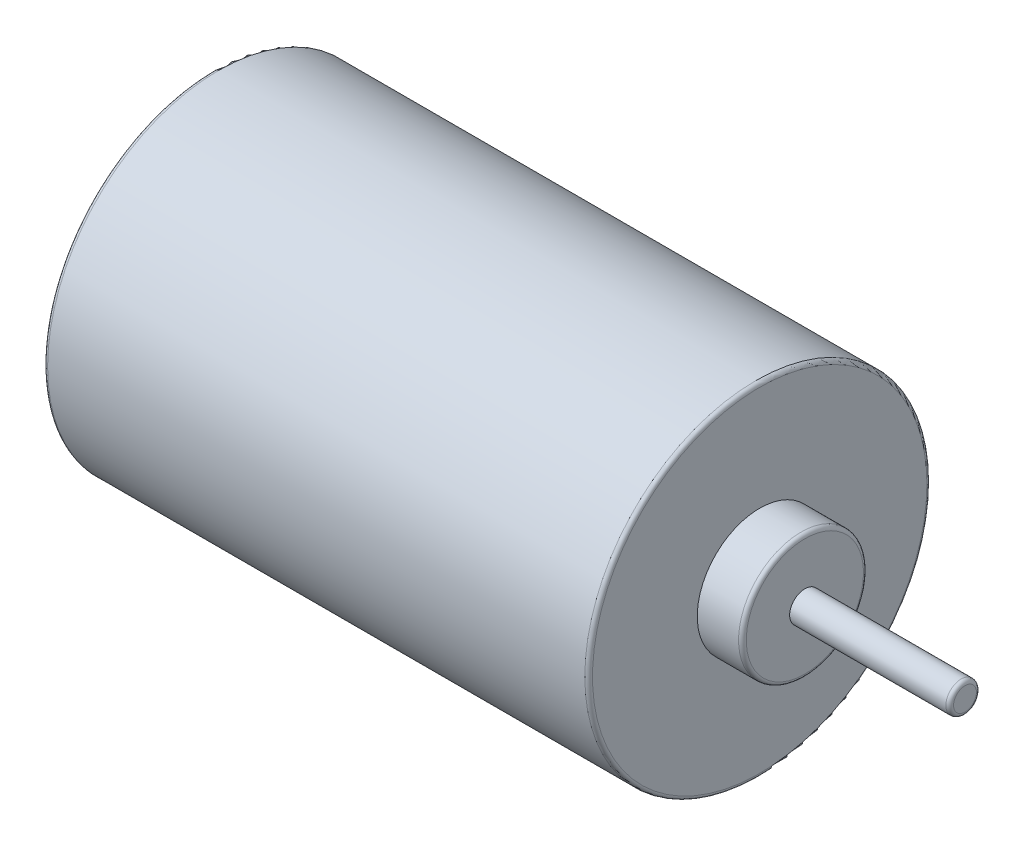
ISO-10303-21;
HEADER;
FILE_DESCRIPTION(('STEP AP214'),'2;1');
FILE_NAME('part.step','',(''),(''),'','','');
FILE_SCHEMA(('AUTOMOTIVE_DESIGN { 1 0 10303 214 1 1 1 1 }'));
ENDSEC;
DATA;
#1=APPLICATION_CONTEXT('core data for automotive mechanical design processes');
#2=APPLICATION_PROTOCOL_DEFINITION('international standard','automotive_design',2000,#1);
#3=PRODUCT_CONTEXT('',#1,'mechanical');
#4=PRODUCT('Part','Part','',(#3));
#5=PRODUCT_RELATED_PRODUCT_CATEGORY('part','',(#4));
#6=PRODUCT_DEFINITION_FORMATION('','',#4);
#7=PRODUCT_DEFINITION_CONTEXT('part definition',#1,'design');
#8=PRODUCT_DEFINITION('design','',#6,#7);
#9=PRODUCT_DEFINITION_SHAPE('','',#8);
#10=(LENGTH_UNIT() NAMED_UNIT(*) SI_UNIT(.MILLI.,.METRE.));
#11=(NAMED_UNIT(*) PLANE_ANGLE_UNIT() SI_UNIT($,.RADIAN.));
#12=(NAMED_UNIT(*) SI_UNIT($,.STERADIAN.) SOLID_ANGLE_UNIT());
#13=UNCERTAINTY_MEASURE_WITH_UNIT(LENGTH_MEASURE(1.E-05),#10,'distance_accuracy_value','');
#14=(GEOMETRIC_REPRESENTATION_CONTEXT(3) GLOBAL_UNCERTAINTY_ASSIGNED_CONTEXT((#13)) GLOBAL_UNIT_ASSIGNED_CONTEXT((#10,
#11,#12)) REPRESENTATION_CONTEXT('',''));
#15=CARTESIAN_POINT('',(0.,0.,0.));
#16=DIRECTION('',(0.,0.,1.));
#17=DIRECTION('',(1.,0.,0.));
#18=AXIS2_PLACEMENT_3D('',#15,#16,#17);
#19=CARTESIAN_POINT('',(56.7,0.,0.));
#20=DIRECTION('',(-1.,0.,0.));
#21=DIRECTION('',(0.,0.,1.));
#22=AXIS2_PLACEMENT_3D('',#19,#20,#21);
#23=CYLINDRICAL_SURFACE('',#22,17.8);
#24=CARTESIAN_POINT('',(56.3,0.,0.));
#25=DIRECTION('',(1.,0.,0.));
#26=DIRECTION('',(0.,0.,-1.));
#27=AXIS2_PLACEMENT_3D('',#24,#25,#26);
#28=CIRCLE('',#27,17.8);
#29=CARTESIAN_POINT('',(56.3,0.,-17.8));
#30=VERTEX_POINT('',#29);
#31=EDGE_CURVE('E59',#30,#30,#28,.F.);
#32=ORIENTED_EDGE('',*,*,#31,.T.);
#33=EDGE_LOOP('',(#32));
#34=FACE_BOUND('',#33,.T.);
#35=CARTESIAN_POINT('',(0.399999999999998,0.,0.));
#36=DIRECTION('',(1.,0.,0.));
#37=DIRECTION('',(0.,0.,-1.));
#38=AXIS2_PLACEMENT_3D('',#35,#36,#37);
#39=CIRCLE('',#38,17.8);
#40=CARTESIAN_POINT('',(0.399999999999998,0.,-17.8));
#41=VERTEX_POINT('',#40);
#42=EDGE_CURVE('E62',#41,#41,#39,.T.);
#43=ORIENTED_EDGE('',*,*,#42,.T.);
#44=EDGE_LOOP('',(#43));
#45=FACE_BOUND('',#44,.T.);
#46=ADVANCED_FACE('F36',(#34,#45),#23,.T.);
#47=CARTESIAN_POINT('',(56.7,0.,0.));
#48=DIRECTION('',(1.,0.,0.));
#49=DIRECTION('',(0.,0.,-1.));
#50=AXIS2_PLACEMENT_3D('',#47,#48,#49);
#51=PLANE('',#50);
#52=CARTESIAN_POINT('',(56.7,0.,0.));
#53=DIRECTION('',(1.,0.,0.));
#54=DIRECTION('',(0.,0.,-1.));
#55=AXIS2_PLACEMENT_3D('',#52,#53,#54);
#56=CIRCLE('',#55,17.4);
#57=CARTESIAN_POINT('',(56.7,0.,-17.4));
#58=VERTEX_POINT('',#57);
#59=EDGE_CURVE('E65',#58,#58,#56,.T.);
#60=ORIENTED_EDGE('',*,*,#59,.T.);
#61=EDGE_LOOP('',(#60));
#62=FACE_BOUND('',#61,.T.);
#63=CARTESIAN_POINT('',(56.7,0.,0.));
#64=DIRECTION('',(1.,0.,0.));
#65=DIRECTION('',(0.,0.,-1.));
#66=AXIS2_PLACEMENT_3D('',#63,#64,#65);
#67=CIRCLE('',#66,6.5);
#68=CARTESIAN_POINT('',(56.7,0.,-6.5));
#69=VERTEX_POINT('',#68);
#70=EDGE_CURVE('E87',#69,#69,#67,.T.);
#71=ORIENTED_EDGE('',*,*,#70,.F.);
#72=EDGE_LOOP('',(#71));
#73=FACE_BOUND('',#72,.T.);
#74=ADVANCED_FACE('F111',(#62,#73),#51,.T.);
#75=CARTESIAN_POINT('',(0.,0.,0.));
#76=DIRECTION('',(1.,0.,0.));
#77=DIRECTION('',(0.,0.,-1.));
#78=AXIS2_PLACEMENT_3D('',#75,#76,#77);
#79=PLANE('',#78);
#80=CARTESIAN_POINT('',(0.,0.,0.));
#81=DIRECTION('',(1.,0.,0.));
#82=DIRECTION('',(0.,0.,-1.));
#83=AXIS2_PLACEMENT_3D('',#80,#81,#82);
#84=CIRCLE('',#83,17.4);
#85=CARTESIAN_POINT('',(0.,0.,-17.4));
#86=VERTEX_POINT('',#85);
#87=EDGE_CURVE('E56',#86,#86,#84,.F.);
#88=ORIENTED_EDGE('',*,*,#87,.T.);
#89=EDGE_LOOP('',(#88));
#90=FACE_BOUND('',#89,.T.);
#91=CARTESIAN_POINT('',(0.,0.,0.));
#92=DIRECTION('',(-1.,0.,0.));
#93=DIRECTION('',(0.,0.,1.));
#94=AXIS2_PLACEMENT_3D('',#91,#92,#93);
#95=CIRCLE('',#94,6.);
#96=CARTESIAN_POINT('',(0.,0.,6.));
#97=VERTEX_POINT('',#96);
#98=EDGE_CURVE('E81',#97,#97,#95,.T.);
#99=ORIENTED_EDGE('',*,*,#98,.F.);
#100=EDGE_LOOP('',(#99));
#101=FACE_BOUND('',#100,.T.);
#102=ADVANCED_FACE('F117',(#90,#101),#79,.F.);
#103=CARTESIAN_POINT('',(-1.,0.,0.));
#104=DIRECTION('',(1.,0.,0.));
#105=DIRECTION('',(0.,0.,-1.));
#106=AXIS2_PLACEMENT_3D('',#103,#104,#105);
#107=CYLINDRICAL_SURFACE('',#106,6.);
#108=CARTESIAN_POINT('',(-0.6,0.,0.));
#109=DIRECTION('',(-1.,0.,0.));
#110=DIRECTION('',(0.,0.,1.));
#111=AXIS2_PLACEMENT_3D('',#108,#109,#110);
#112=CIRCLE('',#111,6.);
#113=CARTESIAN_POINT('',(-0.6,0.,6.));
#114=VERTEX_POINT('',#113);
#115=EDGE_CURVE('E47',#114,#114,#112,.F.);
#116=ORIENTED_EDGE('',*,*,#115,.T.);
#117=EDGE_LOOP('',(#116));
#118=FACE_BOUND('',#117,.T.);
#119=ORIENTED_EDGE('',*,*,#98,.T.);
#120=EDGE_LOOP('',(#119));
#121=FACE_BOUND('',#120,.T.);
#122=ADVANCED_FACE('F153',(#118,#121),#107,.T.);
#123=CARTESIAN_POINT('',(-1.,0.,0.));
#124=DIRECTION('',(-1.,0.,0.));
#125=DIRECTION('',(0.,0.,1.));
#126=AXIS2_PLACEMENT_3D('',#123,#124,#125);
#127=PLANE('',#126);
#128=CARTESIAN_POINT('',(-1.,0.,0.));
#129=DIRECTION('',(-1.,0.,0.));
#130=DIRECTION('',(0.,0.,1.));
#131=AXIS2_PLACEMENT_3D('',#128,#129,#130);
#132=CIRCLE('',#131,5.6);
#133=CARTESIAN_POINT('',(-1.,0.,5.6));
#134=VERTEX_POINT('',#133);
#135=EDGE_CURVE('E51',#134,#134,#132,.T.);
#136=ORIENTED_EDGE('',*,*,#135,.T.);
#137=EDGE_LOOP('',(#136));
#138=FACE_BOUND('',#137,.T.);
#139=CARTESIAN_POINT('',(-1.,0.,0.));
#140=DIRECTION('',(-1.,0.,0.));
#141=DIRECTION('',(0.,0.,1.));
#142=AXIS2_PLACEMENT_3D('',#139,#140,#141);
#143=CIRCLE('',#142,5.);
#144=CARTESIAN_POINT('',(-1.,0.,5.));
#145=VERTEX_POINT('',#144);
#146=EDGE_CURVE('E84',#145,#145,#143,.T.);
#147=ORIENTED_EDGE('',*,*,#146,.F.);
#148=EDGE_LOOP('',(#147));
#149=FACE_BOUND('',#148,.T.);
#150=ADVANCED_FACE('F149',(#138,#149),#127,.T.);
#151=CARTESIAN_POINT('',(-2.,0.,0.));
#152=DIRECTION('',(1.,0.,0.));
#153=DIRECTION('',(0.,0.,-1.));
#154=AXIS2_PLACEMENT_3D('',#151,#152,#153);
#155=CYLINDRICAL_SURFACE('',#154,5.);
#156=CARTESIAN_POINT('',(-1.6,0.,0.));
#157=DIRECTION('',(-1.,0.,0.));
#158=DIRECTION('',(0.,0.,1.));
#159=AXIS2_PLACEMENT_3D('',#156,#157,#158);
#160=CIRCLE('',#159,5.);
#161=CARTESIAN_POINT('',(-1.6,0.,5.));
#162=VERTEX_POINT('',#161);
#163=EDGE_CURVE('E10',#162,#162,#160,.F.);
#164=ORIENTED_EDGE('',*,*,#163,.T.);
#165=EDGE_LOOP('',(#164));
#166=FACE_BOUND('',#165,.T.);
#167=ORIENTED_EDGE('',*,*,#146,.T.);
#168=EDGE_LOOP('',(#167));
#169=FACE_BOUND('',#168,.T.);
#170=ADVANCED_FACE('F152',(#166,#169),#155,.T.);
#171=CARTESIAN_POINT('',(-2.,0.,0.));
#172=DIRECTION('',(-1.,0.,0.));
#173=DIRECTION('',(0.,0.,1.));
#174=AXIS2_PLACEMENT_3D('',#171,#172,#173);
#175=PLANE('',#174);
#176=CARTESIAN_POINT('',(-2.,0.,0.));
#177=DIRECTION('',(-1.,0.,0.));
#178=DIRECTION('',(0.,0.,1.));
#179=AXIS2_PLACEMENT_3D('',#176,#177,#178);
#180=CIRCLE('',#179,4.6);
#181=CARTESIAN_POINT('',(-2.,0.,4.6));
#182=VERTEX_POINT('',#181);
#183=EDGE_CURVE('E43',#182,#182,#180,.T.);
#184=ORIENTED_EDGE('',*,*,#183,.T.);
#185=EDGE_LOOP('',(#184));
#186=FACE_BOUND('',#185,.T.);
#187=ADVANCED_FACE('F107',(#186),#175,.T.);
#188=CARTESIAN_POINT('',(61.4,0.,0.));
#189=DIRECTION('',(-1.,0.,0.));
#190=DIRECTION('',(0.,0.,1.));
#191=AXIS2_PLACEMENT_3D('',#188,#189,#190);
#192=CYLINDRICAL_SURFACE('',#191,6.5);
#193=CARTESIAN_POINT('',(61.,0.,0.));
#194=DIRECTION('',(1.,0.,0.));
#195=DIRECTION('',(0.,0.,-1.));
#196=AXIS2_PLACEMENT_3D('',#193,#194,#195);
#197=CIRCLE('',#196,6.5);
#198=CARTESIAN_POINT('',(61.,0.,-6.5));
#199=VERTEX_POINT('',#198);
#200=EDGE_CURVE('E68',#199,#199,#197,.F.);
#201=ORIENTED_EDGE('',*,*,#200,.T.);
#202=EDGE_LOOP('',(#201));
#203=FACE_BOUND('',#202,.T.);
#204=ORIENTED_EDGE('',*,*,#70,.T.);
#205=EDGE_LOOP('',(#204));
#206=FACE_BOUND('',#205,.T.);
#207=ADVANCED_FACE('F97',(#203,#206),#192,.T.);
#208=CARTESIAN_POINT('',(61.4,0.,0.));
#209=DIRECTION('',(1.,0.,0.));
#210=DIRECTION('',(0.,0.,-1.));
#211=AXIS2_PLACEMENT_3D('',#208,#209,#210);
#212=PLANE('',#211);
#213=CARTESIAN_POINT('',(61.4,0.,0.));
#214=DIRECTION('',(1.,0.,0.));
#215=DIRECTION('',(0.,0.,-1.));
#216=AXIS2_PLACEMENT_3D('',#213,#214,#215);
#217=CIRCLE('',#216,6.1);
#218=CARTESIAN_POINT('',(61.4,0.,-6.1));
#219=VERTEX_POINT('',#218);
#220=EDGE_CURVE('E71',#219,#219,#217,.T.);
#221=ORIENTED_EDGE('',*,*,#220,.T.);
#222=EDGE_LOOP('',(#221));
#223=FACE_BOUND('',#222,.T.);
#224=CARTESIAN_POINT('',(61.4,0.,0.));
#225=DIRECTION('',(1.,0.,0.));
#226=DIRECTION('',(0.,0.,-1.));
#227=AXIS2_PLACEMENT_3D('',#224,#225,#226);
#228=CIRCLE('',#227,1.5875);
#229=CARTESIAN_POINT('',(61.4,0.,-1.5875));
#230=VERTEX_POINT('',#229);
#231=EDGE_CURVE('E80',#230,#230,#228,.T.);
#232=ORIENTED_EDGE('',*,*,#231,.F.);
#233=EDGE_LOOP('',(#232));
#234=FACE_BOUND('',#233,.T.);
#235=ADVANCED_FACE('F95',(#223,#234),#212,.T.);
#236=CARTESIAN_POINT('',(78.06,0.,0.));
#237=DIRECTION('',(-1.,0.,0.));
#238=DIRECTION('',(0.,0.,1.));
#239=AXIS2_PLACEMENT_3D('',#236,#237,#238);
#240=CYLINDRICAL_SURFACE('',#239,1.5875);
#241=CARTESIAN_POINT('',(77.66,0.,0.));
#242=DIRECTION('',(1.,0.,0.));
#243=DIRECTION('',(0.,0.,-1.));
#244=AXIS2_PLACEMENT_3D('',#241,#242,#243);
#245=CIRCLE('',#244,1.5875);
#246=CARTESIAN_POINT('',(77.66,0.,-1.5875));
#247=VERTEX_POINT('',#246);
#248=EDGE_CURVE('E74',#247,#247,#245,.F.);
#249=ORIENTED_EDGE('',*,*,#248,.T.);
#250=EDGE_LOOP('',(#249));
#251=FACE_BOUND('',#250,.T.);
#252=ORIENTED_EDGE('',*,*,#231,.T.);
#253=EDGE_LOOP('',(#252));
#254=FACE_BOUND('',#253,.T.);
#255=ADVANCED_FACE('F93',(#251,#254),#240,.T.);
#256=CARTESIAN_POINT('',(78.06,0.,0.));
#257=DIRECTION('',(1.,0.,0.));
#258=DIRECTION('',(0.,0.,-1.));
#259=AXIS2_PLACEMENT_3D('',#256,#257,#258);
#260=PLANE('',#259);
#261=CARTESIAN_POINT('',(78.06,0.,0.));
#262=DIRECTION('',(1.,0.,0.));
#263=DIRECTION('',(0.,0.,-1.));
#264=AXIS2_PLACEMENT_3D('',#261,#262,#263);
#265=CIRCLE('',#264,1.1875);
#266=CARTESIAN_POINT('',(78.06,0.,-1.1875));
#267=VERTEX_POINT('',#266);
#268=EDGE_CURVE('E77',#267,#267,#265,.T.);
#269=ORIENTED_EDGE('',*,*,#268,.T.);
#270=EDGE_LOOP('',(#269));
#271=FACE_BOUND('',#270,.T.);
#272=ADVANCED_FACE('F104',(#271),#260,.T.);
#273=CARTESIAN_POINT('',(77.66,0.,0.));
#274=DIRECTION('',(1.,0.,0.));
#275=DIRECTION('',(0.,0.,-1.));
#276=AXIS2_PLACEMENT_3D('',#273,#274,#275);
#277=TOROIDAL_SURFACE('',#276,1.1875,0.4);
#278=ORIENTED_EDGE('',*,*,#248,.F.);
#279=EDGE_LOOP('',(#278));
#280=FACE_BOUND('',#279,.T.);
#281=ORIENTED_EDGE('',*,*,#268,.F.);
#282=EDGE_LOOP('',(#281));
#283=FACE_BOUND('',#282,.T.);
#284=ADVANCED_FACE('F123',(#280,#283),#277,.T.);
#285=CARTESIAN_POINT('',(61.,0.,0.));
#286=DIRECTION('',(1.,0.,0.));
#287=DIRECTION('',(0.,0.,-1.));
#288=AXIS2_PLACEMENT_3D('',#285,#286,#287);
#289=TOROIDAL_SURFACE('',#288,6.1,0.4);
#290=ORIENTED_EDGE('',*,*,#200,.F.);
#291=EDGE_LOOP('',(#290));
#292=FACE_BOUND('',#291,.T.);
#293=ORIENTED_EDGE('',*,*,#220,.F.);
#294=EDGE_LOOP('',(#293));
#295=FACE_BOUND('',#294,.T.);
#296=ADVANCED_FACE('F126',(#292,#295),#289,.T.);
#297=CARTESIAN_POINT('',(56.3,0.,0.));
#298=DIRECTION('',(1.,0.,0.));
#299=DIRECTION('',(0.,0.,-1.));
#300=AXIS2_PLACEMENT_3D('',#297,#298,#299);
#301=TOROIDAL_SURFACE('',#300,17.4,0.4);
#302=ORIENTED_EDGE('',*,*,#31,.F.);
#303=EDGE_LOOP('',(#302));
#304=FACE_BOUND('',#303,.T.);
#305=ORIENTED_EDGE('',*,*,#59,.F.);
#306=EDGE_LOOP('',(#305));
#307=FACE_BOUND('',#306,.T.);
#308=ADVANCED_FACE('F130',(#304,#307),#301,.T.);
#309=CARTESIAN_POINT('',(0.399999999999998,0.,0.));
#310=DIRECTION('',(1.,0.,0.));
#311=DIRECTION('',(0.,0.,-1.));
#312=AXIS2_PLACEMENT_3D('',#309,#310,#311);
#313=TOROIDAL_SURFACE('',#312,17.4,0.4);
#314=ORIENTED_EDGE('',*,*,#87,.F.);
#315=EDGE_LOOP('',(#314));
#316=FACE_BOUND('',#315,.T.);
#317=ORIENTED_EDGE('',*,*,#42,.F.);
#318=EDGE_LOOP('',(#317));
#319=FACE_BOUND('',#318,.T.);
#320=ADVANCED_FACE('F134',(#316,#319),#313,.T.);
#321=CARTESIAN_POINT('',(-0.6,0.,0.));
#322=DIRECTION('',(-1.,0.,0.));
#323=DIRECTION('',(0.,0.,1.));
#324=AXIS2_PLACEMENT_3D('',#321,#322,#323);
#325=TOROIDAL_SURFACE('',#324,5.6,0.4);
#326=ORIENTED_EDGE('',*,*,#115,.F.);
#327=EDGE_LOOP('',(#326));
#328=FACE_BOUND('',#327,.T.);
#329=ORIENTED_EDGE('',*,*,#135,.F.);
#330=EDGE_LOOP('',(#329));
#331=FACE_BOUND('',#330,.T.);
#332=ADVANCED_FACE('F137',(#328,#331),#325,.T.);
#333=CARTESIAN_POINT('',(-1.6,0.,0.));
#334=DIRECTION('',(-1.,0.,0.));
#335=DIRECTION('',(0.,0.,1.));
#336=AXIS2_PLACEMENT_3D('',#333,#334,#335);
#337=TOROIDAL_SURFACE('',#336,4.6,0.4);
#338=ORIENTED_EDGE('',*,*,#163,.F.);
#339=EDGE_LOOP('',(#338));
#340=FACE_BOUND('',#339,.T.);
#341=ORIENTED_EDGE('',*,*,#183,.F.);
#342=EDGE_LOOP('',(#341));
#343=FACE_BOUND('',#342,.T.);
#344=ADVANCED_FACE('F38',(#340,#343),#337,.T.);
#345=CLOSED_SHELL('',(#46,#74,#102,#122,#150,#170,#187,#207,#235,#255,#272,#284,#296,#308,#320,
#332,#344));
#346=MANIFOLD_SOLID_BREP('B2',#345);
#347=ADVANCED_BREP_SHAPE_REPRESENTATION('',(#18,#346),#14);
#348=SHAPE_DEFINITION_REPRESENTATION(#9,#347);
ENDSEC;
END-ISO-10303-21;
